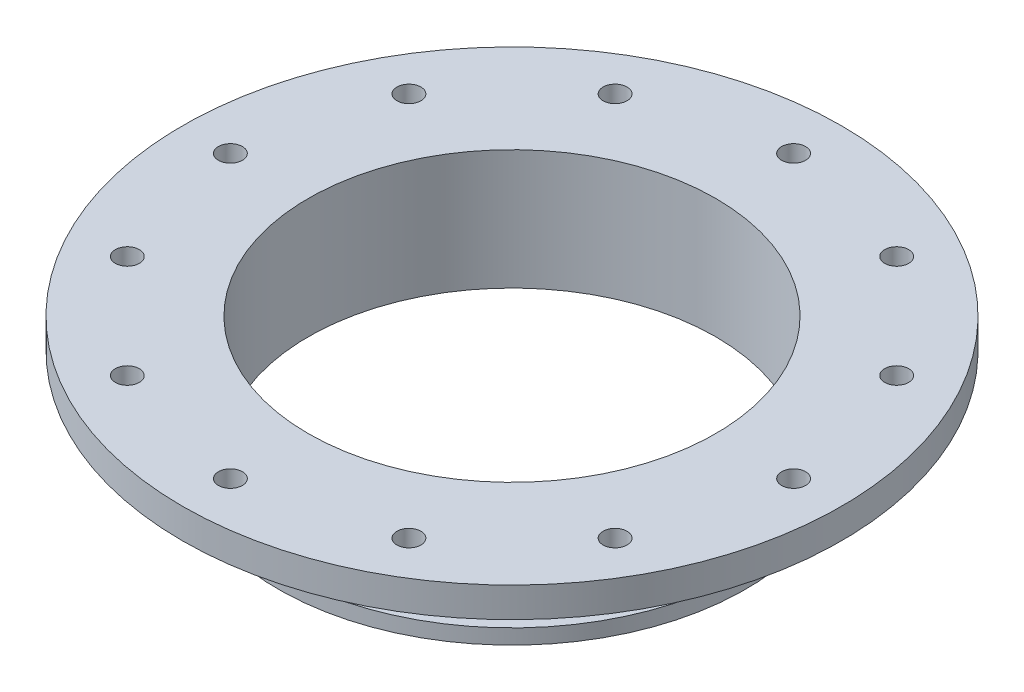
ISO-10303-21;
HEADER;
FILE_DESCRIPTION(('STEP AP214'),'2;1');
FILE_NAME('part.step','',(''),(''),'','','');
FILE_SCHEMA(('AUTOMOTIVE_DESIGN { 1 0 10303 214 1 1 1 1 }'));
ENDSEC;
DATA;
#1=APPLICATION_CONTEXT('core data for automotive mechanical design processes');
#2=APPLICATION_PROTOCOL_DEFINITION('international standard','automotive_design',2000,#1);
#3=PRODUCT_CONTEXT('',#1,'mechanical');
#4=PRODUCT('Part','Part','',(#3));
#5=PRODUCT_RELATED_PRODUCT_CATEGORY('part','',(#4));
#6=PRODUCT_DEFINITION_FORMATION('','',#4);
#7=PRODUCT_DEFINITION_CONTEXT('part definition',#1,'design');
#8=PRODUCT_DEFINITION('design','',#6,#7);
#9=PRODUCT_DEFINITION_SHAPE('','',#8);
#10=(LENGTH_UNIT() NAMED_UNIT(*) SI_UNIT(.MILLI.,.METRE.));
#11=(NAMED_UNIT(*) PLANE_ANGLE_UNIT() SI_UNIT($,.RADIAN.));
#12=(NAMED_UNIT(*) SI_UNIT($,.STERADIAN.) SOLID_ANGLE_UNIT());
#13=UNCERTAINTY_MEASURE_WITH_UNIT(LENGTH_MEASURE(1.E-05),#10,'distance_accuracy_value','');
#14=(GEOMETRIC_REPRESENTATION_CONTEXT(3) GLOBAL_UNCERTAINTY_ASSIGNED_CONTEXT((#13)) GLOBAL_UNIT_ASSIGNED_CONTEXT((#10,
#11,#12)) REPRESENTATION_CONTEXT('',''));
#15=CARTESIAN_POINT('',(0.,0.,0.));
#16=DIRECTION('',(0.,0.,1.));
#17=DIRECTION('',(1.,0.,0.));
#18=AXIS2_PLACEMENT_3D('',#15,#16,#17);
#19=CARTESIAN_POINT('',(0.,-25.4,0.));
#20=DIRECTION('',(0.,1.,0.));
#21=DIRECTION('',(0.,0.,1.));
#22=AXIS2_PLACEMENT_3D('',#19,#20,#21);
#23=CYLINDRICAL_SURFACE('',#22,49.53);
#24=CARTESIAN_POINT('',(0.,-6.35,0.));
#25=DIRECTION('',(0.,-1.,0.));
#26=DIRECTION('',(0.,0.,-1.));
#27=AXIS2_PLACEMENT_3D('',#24,#25,#26);
#28=CIRCLE('',#27,49.53);
#29=CARTESIAN_POINT('',(0.,-6.35,-49.53));
#30=VERTEX_POINT('',#29);
#31=EDGE_CURVE('E55',#30,#30,#28,.T.);
#32=ORIENTED_EDGE('',*,*,#31,.T.);
#33=EDGE_LOOP('',(#32));
#34=FACE_BOUND('',#33,.T.);
#35=CARTESIAN_POINT('',(0.,-9.52500000000001,0.));
#36=DIRECTION('',(0.,1.,0.));
#37=DIRECTION('',(-1.,0.,0.));
#38=AXIS2_PLACEMENT_3D('',#35,#36,#37);
#39=CIRCLE('',#38,49.53);
#40=CARTESIAN_POINT('',(-49.53,-9.52500000000001,0.));
#41=VERTEX_POINT('',#40);
#42=EDGE_CURVE('E64',#41,#41,#39,.T.);
#43=ORIENTED_EDGE('',*,*,#42,.T.);
#44=EDGE_LOOP('',(#43));
#45=FACE_BOUND('',#44,.T.);
#46=ADVANCED_FACE('F37',(#34,#45),#23,.T.);
#47=CARTESIAN_POINT('',(43.18,-6.35,0.));
#48=DIRECTION('',(0.,-1.,0.));
#49=DIRECTION('',(0.,0.,-1.));
#50=AXIS2_PLACEMENT_3D('',#47,#48,#49);
#51=PLANE('',#50);
#52=CARTESIAN_POINT('',(-29.8449999999999,-6.35,-51.6930563518932));
#53=DIRECTION('',(0.,-1.,0.));
#54=DIRECTION('',(0.,0.,-1.));
#55=AXIS2_PLACEMENT_3D('',#52,#53,#54);
#56=CIRCLE('',#55,2.54);
#57=CARTESIAN_POINT('',(-29.8449999999999,-6.35,-54.2330563518932));
#58=VERTEX_POINT('',#57);
#59=EDGE_CURVE('E105',#58,#58,#56,.T.);
#60=ORIENTED_EDGE('',*,*,#59,.F.);
#61=EDGE_LOOP('',(#60));
#62=FACE_BOUND('',#61,.T.);
#63=CARTESIAN_POINT('',(2.07162279967613E-13,-6.35,-59.69));
#64=DIRECTION('',(0.,-1.,0.));
#65=DIRECTION('',(0.,0.,-1.));
#66=AXIS2_PLACEMENT_3D('',#63,#64,#65);
#67=CIRCLE('',#66,2.54);
#68=CARTESIAN_POINT('',(2.07162279967613E-13,-6.35,-62.23));
#69=VERTEX_POINT('',#68);
#70=EDGE_CURVE('E108',#69,#69,#67,.T.);
#71=ORIENTED_EDGE('',*,*,#70,.F.);
#72=EDGE_LOOP('',(#71));
#73=FACE_BOUND('',#72,.T.);
#74=CARTESIAN_POINT('',(29.8450000000003,-6.35,-51.693056351893));
#75=DIRECTION('',(0.,-1.,0.));
#76=DIRECTION('',(0.,0.,-1.));
#77=AXIS2_PLACEMENT_3D('',#74,#75,#76);
#78=CIRCLE('',#77,2.54);
#79=CARTESIAN_POINT('',(29.8450000000003,-6.35,-54.233056351893));
#80=VERTEX_POINT('',#79);
#81=EDGE_CURVE('E111',#80,#80,#78,.T.);
#82=ORIENTED_EDGE('',*,*,#81,.F.);
#83=EDGE_LOOP('',(#82));
#84=FACE_BOUND('',#83,.T.);
#85=CARTESIAN_POINT('',(51.6930563518933,-6.35,-29.8449999999997));
#86=DIRECTION('',(0.,-1.,0.));
#87=DIRECTION('',(0.,0.,-1.));
#88=AXIS2_PLACEMENT_3D('',#85,#86,#87);
#89=CIRCLE('',#88,2.54);
#90=CARTESIAN_POINT('',(51.6930563518933,-6.35,-32.3849999999997));
#91=VERTEX_POINT('',#90);
#92=EDGE_CURVE('E114',#91,#91,#89,.T.);
#93=ORIENTED_EDGE('',*,*,#92,.F.);
#94=EDGE_LOOP('',(#93));
#95=FACE_BOUND('',#94,.T.);
#96=CARTESIAN_POINT('',(59.69,-6.35,0.));
#97=DIRECTION('',(0.,-1.,0.));
#98=DIRECTION('',(0.,0.,-1.));
#99=AXIS2_PLACEMENT_3D('',#96,#97,#98);
#100=CIRCLE('',#99,2.54);
#101=CARTESIAN_POINT('',(59.69,-6.35,-2.54));
#102=VERTEX_POINT('',#101);
#103=EDGE_CURVE('E117',#102,#102,#100,.T.);
#104=ORIENTED_EDGE('',*,*,#103,.F.);
#105=EDGE_LOOP('',(#104));
#106=FACE_BOUND('',#105,.T.);
#107=CARTESIAN_POINT('',(51.6930563518929,-6.35,29.8450000000004));
#108=DIRECTION('',(0.,-1.,0.));
#109=DIRECTION('',(0.,0.,-1.));
#110=AXIS2_PLACEMENT_3D('',#107,#108,#109);
#111=CIRCLE('',#110,2.54);
#112=CARTESIAN_POINT('',(51.6930563518929,-6.35,27.3050000000004));
#113=VERTEX_POINT('',#112);
#114=EDGE_CURVE('E120',#113,#113,#111,.T.);
#115=ORIENTED_EDGE('',*,*,#114,.F.);
#116=EDGE_LOOP('',(#115));
#117=FACE_BOUND('',#116,.T.);
#118=CARTESIAN_POINT('',(29.8449999999995,-6.35,51.6930563518934));
#119=DIRECTION('',(0.,-1.,0.));
#120=DIRECTION('',(0.,0.,-1.));
#121=AXIS2_PLACEMENT_3D('',#118,#119,#120);
#122=CIRCLE('',#121,2.54);
#123=CARTESIAN_POINT('',(29.8449999999995,-6.35,49.1530563518934));
#124=VERTEX_POINT('',#123);
#125=EDGE_CURVE('E123',#124,#124,#122,.T.);
#126=ORIENTED_EDGE('',*,*,#125,.F.);
#127=EDGE_LOOP('',(#126));
#128=FACE_BOUND('',#127,.T.);
#129=CARTESIAN_POINT('',(-6.23975322198706E-13,-6.35,59.69));
#130=DIRECTION('',(0.,-1.,0.));
#131=DIRECTION('',(0.,0.,-1.));
#132=AXIS2_PLACEMENT_3D('',#129,#130,#131);
#133=CIRCLE('',#132,2.54);
#134=CARTESIAN_POINT('',(-6.23975322198706E-13,-6.35,57.15));
#135=VERTEX_POINT('',#134);
#136=EDGE_CURVE('E126',#135,#135,#133,.T.);
#137=ORIENTED_EDGE('',*,*,#136,.F.);
#138=EDGE_LOOP('',(#137));
#139=FACE_BOUND('',#138,.T.);
#140=CARTESIAN_POINT('',(-29.8450000000006,-6.35,51.6930563518928));
#141=DIRECTION('',(0.,-1.,0.));
#142=DIRECTION('',(0.,0.,-1.));
#143=AXIS2_PLACEMENT_3D('',#140,#141,#142);
#144=CIRCLE('',#143,2.54);
#145=CARTESIAN_POINT('',(-29.8450000000006,-6.35,49.1530563518928));
#146=VERTEX_POINT('',#145);
#147=EDGE_CURVE('E129',#146,#146,#144,.T.);
#148=ORIENTED_EDGE('',*,*,#147,.F.);
#149=EDGE_LOOP('',(#148));
#150=FACE_BOUND('',#149,.T.);
#151=CARTESIAN_POINT('',(-51.6930563518935,-6.35,29.8449999999993));
#152=DIRECTION('',(0.,-1.,0.));
#153=DIRECTION('',(0.,0.,-1.));
#154=AXIS2_PLACEMENT_3D('',#151,#152,#153);
#155=CIRCLE('',#154,2.54);
#156=CARTESIAN_POINT('',(-51.6930563518935,-6.35,27.3049999999993));
#157=VERTEX_POINT('',#156);
#158=EDGE_CURVE('E132',#157,#157,#155,.T.);
#159=ORIENTED_EDGE('',*,*,#158,.F.);
#160=EDGE_LOOP('',(#159));
#161=FACE_BOUND('',#160,.T.);
#162=CARTESIAN_POINT('',(-51.6930563518931,-6.35,-29.8450000000001));
#163=DIRECTION('',(0.,-1.,0.));
#164=DIRECTION('',(0.,0.,-1.));
#165=AXIS2_PLACEMENT_3D('',#162,#163,#164);
#166=CIRCLE('',#165,2.54);
#167=CARTESIAN_POINT('',(-51.6930563518931,-6.35,-32.3850000000001));
#168=VERTEX_POINT('',#167);
#169=EDGE_CURVE('E135',#168,#168,#166,.T.);
#170=ORIENTED_EDGE('',*,*,#169,.F.);
#171=EDGE_LOOP('',(#170));
#172=FACE_BOUND('',#171,.T.);
#173=CARTESIAN_POINT('',(-59.69,-6.35,0.));
#174=DIRECTION('',(0.,-1.,0.));
#175=DIRECTION('',(0.,0.,-1.));
#176=AXIS2_PLACEMENT_3D('',#173,#174,#175);
#177=CIRCLE('',#176,2.54);
#178=CARTESIAN_POINT('',(-59.69,-6.35,-2.54));
#179=VERTEX_POINT('',#178);
#180=EDGE_CURVE('E77',#179,#179,#177,.T.);
#181=ORIENTED_EDGE('',*,*,#180,.F.);
#182=EDGE_LOOP('',(#181));
#183=FACE_BOUND('',#182,.T.);
#184=CARTESIAN_POINT('',(0.,-6.34999999999999,0.));
#185=DIRECTION('',(0.,-1.,0.));
#186=DIRECTION('',(0.,0.,-1.));
#187=AXIS2_PLACEMENT_3D('',#184,#185,#186);
#188=CIRCLE('',#187,69.85);
#189=CARTESIAN_POINT('',(0.,-6.34999999999999,-69.85));
#190=VERTEX_POINT('',#189);
#191=EDGE_CURVE('E44',#190,#190,#188,.T.);
#192=ORIENTED_EDGE('',*,*,#191,.T.);
#193=EDGE_LOOP('',(#192));
#194=FACE_BOUND('',#193,.T.);
#195=ORIENTED_EDGE('',*,*,#31,.F.);
#196=EDGE_LOOP('',(#195));
#197=FACE_BOUND('',#196,.T.);
#198=ADVANCED_FACE('F177',(#62,#73,#84,#95,#106,#117,#128,#139,#150,#161,#172,#183,#194,#197),
#51,.T.);
#199=CARTESIAN_POINT('',(43.18,0.,0.));
#200=DIRECTION('',(0.,1.,0.));
#201=DIRECTION('',(0.,0.,1.));
#202=AXIS2_PLACEMENT_3D('',#199,#200,#201);
#203=PLANE('',#202);
#204=CARTESIAN_POINT('',(-29.8449999999999,0.,-51.6930563518932));
#205=DIRECTION('',(0.,1.,0.));
#206=DIRECTION('',(-0.86602540378444,0.,0.499999999999998));
#207=AXIS2_PLACEMENT_3D('',#204,#205,#206);
#208=CIRCLE('',#207,2.54);
#209=CARTESIAN_POINT('',(-32.0447045256124,0.,-50.4230563518932));
#210=VERTEX_POINT('',#209);
#211=EDGE_CURVE('E141',#210,#210,#208,.T.);
#212=ORIENTED_EDGE('',*,*,#211,.F.);
#213=EDGE_LOOP('',(#212));
#214=FACE_BOUND('',#213,.T.);
#215=CARTESIAN_POINT('',(2.07162279967613E-13,0.,-59.69));
#216=DIRECTION('',(0.,1.,0.));
#217=DIRECTION('',(-1.,0.,0.));
#218=AXIS2_PLACEMENT_3D('',#215,#216,#217);
#219=CIRCLE('',#218,2.54);
#220=CARTESIAN_POINT('',(-2.53999999999979,0.,-59.69));
#221=VERTEX_POINT('',#220);
#222=EDGE_CURVE('E161',#221,#221,#219,.T.);
#223=ORIENTED_EDGE('',*,*,#222,.F.);
#224=EDGE_LOOP('',(#223));
#225=FACE_BOUND('',#224,.T.);
#226=CARTESIAN_POINT('',(29.8450000000003,0.,-51.693056351893));
#227=DIRECTION('',(0.,1.,0.));
#228=DIRECTION('',(-0.866025403784436,0.,-0.500000000000004));
#229=AXIS2_PLACEMENT_3D('',#226,#227,#228);
#230=CIRCLE('',#229,2.54);
#231=CARTESIAN_POINT('',(27.6452954743878,0.,-52.963056351893));
#232=VERTEX_POINT('',#231);
#233=EDGE_CURVE('E158',#232,#232,#230,.T.);
#234=ORIENTED_EDGE('',*,*,#233,.F.);
#235=EDGE_LOOP('',(#234));
#236=FACE_BOUND('',#235,.T.);
#237=CARTESIAN_POINT('',(51.6930563518933,0.,-29.8449999999997));
#238=DIRECTION('',(0.,1.,0.));
#239=DIRECTION('',(-0.499999999999995,0.,-0.866025403784442));
#240=AXIS2_PLACEMENT_3D('',#237,#238,#239);
#241=CIRCLE('',#240,2.54);
#242=CARTESIAN_POINT('',(50.4230563518933,0.,-32.0447045256122));
#243=VERTEX_POINT('',#242);
#244=EDGE_CURVE('E155',#243,#243,#241,.T.);
#245=ORIENTED_EDGE('',*,*,#244,.F.);
#246=EDGE_LOOP('',(#245));
#247=FACE_BOUND('',#246,.T.);
#248=CARTESIAN_POINT('',(59.69,0.,0.));
#249=DIRECTION('',(0.,1.,0.));
#250=DIRECTION('',(0.,0.,-1.));
#251=AXIS2_PLACEMENT_3D('',#248,#249,#250);
#252=CIRCLE('',#251,2.54);
#253=CARTESIAN_POINT('',(59.69,0.,-2.54));
#254=VERTEX_POINT('',#253);
#255=EDGE_CURVE('E152',#254,#254,#252,.T.);
#256=ORIENTED_EDGE('',*,*,#255,.F.);
#257=EDGE_LOOP('',(#256));
#258=FACE_BOUND('',#257,.T.);
#259=CARTESIAN_POINT('',(51.6930563518929,0.,29.8450000000004));
#260=DIRECTION('',(0.,1.,0.));
#261=DIRECTION('',(0.500000000000007,0.,-0.866025403784435));
#262=AXIS2_PLACEMENT_3D('',#259,#260,#261);
#263=CIRCLE('',#262,2.54);
#264=CARTESIAN_POINT('',(52.9630563518929,0.,27.645295474388));
#265=VERTEX_POINT('',#264);
#266=EDGE_CURVE('E149',#265,#265,#263,.T.);
#267=ORIENTED_EDGE('',*,*,#266,.F.);
#268=EDGE_LOOP('',(#267));
#269=FACE_BOUND('',#268,.T.);
#270=CARTESIAN_POINT('',(29.8449999999995,0.,51.6930563518934));
#271=DIRECTION('',(0.,1.,0.));
#272=DIRECTION('',(0.866025403784443,0.,-0.499999999999992));
#273=AXIS2_PLACEMENT_3D('',#270,#271,#272);
#274=CIRCLE('',#273,2.54);
#275=CARTESIAN_POINT('',(32.044704525612,0.,50.4230563518935));
#276=VERTEX_POINT('',#275);
#277=EDGE_CURVE('E145',#276,#276,#274,.T.);
#278=ORIENTED_EDGE('',*,*,#277,.F.);
#279=EDGE_LOOP('',(#278));
#280=FACE_BOUND('',#279,.T.);
#281=CARTESIAN_POINT('',(-6.23975322198706E-13,0.,59.69));
#282=DIRECTION('',(0.,1.,0.));
#283=DIRECTION('',(1.,0.,0.));
#284=AXIS2_PLACEMENT_3D('',#281,#282,#283);
#285=CIRCLE('',#284,2.54);
#286=CARTESIAN_POINT('',(2.53999999999938,0.,59.69));
#287=VERTEX_POINT('',#286);
#288=EDGE_CURVE('E142',#287,#287,#285,.T.);
#289=ORIENTED_EDGE('',*,*,#288,.F.);
#290=EDGE_LOOP('',(#289));
#291=FACE_BOUND('',#290,.T.);
#292=CARTESIAN_POINT('',(-29.8450000000006,0.,51.6930563518928));
#293=DIRECTION('',(0.,1.,0.));
#294=DIRECTION('',(0.866025403784433,0.,0.50000000000001));
#295=AXIS2_PLACEMENT_3D('',#292,#293,#294);
#296=CIRCLE('',#295,2.54);
#297=CARTESIAN_POINT('',(-27.6452954743881,0.,52.9630563518928));
#298=VERTEX_POINT('',#297);
#299=EDGE_CURVE('E146',#298,#298,#296,.T.);
#300=ORIENTED_EDGE('',*,*,#299,.F.);
#301=EDGE_LOOP('',(#300));
#302=FACE_BOUND('',#301,.T.);
#303=CARTESIAN_POINT('',(-51.6930563518935,0.,29.8449999999993));
#304=DIRECTION('',(0.,1.,0.));
#305=DIRECTION('',(0.499999999999989,0.,0.866025403784445));
#306=AXIS2_PLACEMENT_3D('',#303,#304,#305);
#307=CIRCLE('',#306,2.54);
#308=CARTESIAN_POINT('',(-50.4230563518936,0.,32.0447045256118));
#309=VERTEX_POINT('',#308);
#310=EDGE_CURVE('E166',#309,#309,#307,.T.);
#311=ORIENTED_EDGE('',*,*,#310,.F.);
#312=EDGE_LOOP('',(#311));
#313=FACE_BOUND('',#312,.T.);
#314=CARTESIAN_POINT('',(-51.6930563518931,0.,-29.8450000000001));
#315=DIRECTION('',(0.,1.,0.));
#316=DIRECTION('',(-0.500000000000001,0.,0.866025403784438));
#317=AXIS2_PLACEMENT_3D('',#314,#315,#316);
#318=CIRCLE('',#317,2.54);
#319=CARTESIAN_POINT('',(-52.9630563518931,0.,-27.6452954743876));
#320=VERTEX_POINT('',#319);
#321=EDGE_CURVE('E138',#320,#320,#318,.T.);
#322=ORIENTED_EDGE('',*,*,#321,.F.);
#323=EDGE_LOOP('',(#322));
#324=FACE_BOUND('',#323,.T.);
#325=CARTESIAN_POINT('',(-59.69,0.,0.));
#326=DIRECTION('',(0.,1.,0.));
#327=DIRECTION('',(0.,0.,1.));
#328=AXIS2_PLACEMENT_3D('',#325,#326,#327);
#329=CIRCLE('',#328,2.54);
#330=CARTESIAN_POINT('',(-59.69,0.,2.54));
#331=VERTEX_POINT('',#330);
#332=EDGE_CURVE('E102',#331,#331,#329,.T.);
#333=ORIENTED_EDGE('',*,*,#332,.F.);
#334=EDGE_LOOP('',(#333));
#335=FACE_BOUND('',#334,.T.);
#336=CARTESIAN_POINT('',(0.,0.,0.));
#337=DIRECTION('',(0.,-1.,0.));
#338=DIRECTION('',(0.,0.,-1.));
#339=AXIS2_PLACEMENT_3D('',#336,#337,#338);
#340=CIRCLE('',#339,43.18);
#341=CARTESIAN_POINT('',(0.,0.,-43.18));
#342=VERTEX_POINT('',#341);
#343=EDGE_CURVE('E10',#342,#342,#340,.T.);
#344=ORIENTED_EDGE('',*,*,#343,.T.);
#345=EDGE_LOOP('',(#344));
#346=FACE_BOUND('',#345,.T.);
#347=CARTESIAN_POINT('',(0.,0.,0.));
#348=DIRECTION('',(0.,-1.,0.));
#349=DIRECTION('',(0.,0.,-1.));
#350=AXIS2_PLACEMENT_3D('',#347,#348,#349);
#351=CIRCLE('',#350,69.85);
#352=CARTESIAN_POINT('',(0.,0.,-69.85));
#353=VERTEX_POINT('',#352);
#354=EDGE_CURVE('E48',#353,#353,#351,.T.);
#355=ORIENTED_EDGE('',*,*,#354,.F.);
#356=EDGE_LOOP('',(#355));
#357=FACE_BOUND('',#356,.T.);
#358=ADVANCED_FACE('F39',(#214,#225,#236,#247,#258,#269,#280,#291,#302,#313,#324,#335,#346,
#357),#203,.T.);
#359=CARTESIAN_POINT('',(0.,-127.,0.));
#360=DIRECTION('',(0.,-1.,0.));
#361=DIRECTION('',(0.,0.,-1.));
#362=AXIS2_PLACEMENT_3D('',#359,#360,#361);
#363=CYLINDRICAL_SURFACE('',#362,43.18);
#364=ORIENTED_EDGE('',*,*,#343,.F.);
#365=EDGE_LOOP('',(#364));
#366=FACE_BOUND('',#365,.T.);
#367=CARTESIAN_POINT('',(0.,-25.4,0.));
#368=DIRECTION('',(0.,-1.,0.));
#369=DIRECTION('',(0.,0.,-1.));
#370=AXIS2_PLACEMENT_3D('',#367,#368,#369);
#371=CIRCLE('',#370,43.18);
#372=CARTESIAN_POINT('',(0.,-25.4,-43.18));
#373=VERTEX_POINT('',#372);
#374=EDGE_CURVE('E58',#373,#373,#371,.T.);
#375=ORIENTED_EDGE('',*,*,#374,.T.);
#376=EDGE_LOOP('',(#375));
#377=FACE_BOUND('',#376,.T.);
#378=ADVANCED_FACE('F176',(#366,#377),#363,.F.);
#379=CARTESIAN_POINT('',(0.,-127.,0.));
#380=DIRECTION('',(0.,-1.,0.));
#381=DIRECTION('',(0.,0.,-1.));
#382=AXIS2_PLACEMENT_3D('',#379,#380,#381);
#383=CYLINDRICAL_SURFACE('',#382,69.85);
#384=ORIENTED_EDGE('',*,*,#354,.T.);
#385=EDGE_LOOP('',(#384));
#386=FACE_BOUND('',#385,.T.);
#387=ORIENTED_EDGE('',*,*,#191,.F.);
#388=EDGE_LOOP('',(#387));
#389=FACE_BOUND('',#388,.T.);
#390=ADVANCED_FACE('F187',(#386,#389),#383,.T.);
#391=CARTESIAN_POINT('',(0.,-25.4,0.));
#392=DIRECTION('',(0.,-1.,0.));
#393=DIRECTION('',(0.,0.,-1.));
#394=AXIS2_PLACEMENT_3D('',#391,#392,#393);
#395=PLANE('',#394);
#396=CARTESIAN_POINT('',(0.,-25.4,0.));
#397=DIRECTION('',(0.,-1.,0.));
#398=DIRECTION('',(0.,0.,-1.));
#399=AXIS2_PLACEMENT_3D('',#396,#397,#398);
#400=CIRCLE('',#399,49.53);
#401=CARTESIAN_POINT('',(0.,-25.4,-49.53));
#402=VERTEX_POINT('',#401);
#403=EDGE_CURVE('E52',#402,#402,#400,.T.);
#404=ORIENTED_EDGE('',*,*,#403,.T.);
#405=EDGE_LOOP('',(#404));
#406=FACE_BOUND('',#405,.T.);
#407=ORIENTED_EDGE('',*,*,#374,.F.);
#408=EDGE_LOOP('',(#407));
#409=FACE_BOUND('',#408,.T.);
#410=ADVANCED_FACE('F190',(#406,#409),#395,.T.);
#411=CARTESIAN_POINT('',(0.,-22.225,0.));
#412=DIRECTION('',(0.,1.,0.));
#413=DIRECTION('',(-1.,0.,0.));
#414=AXIS2_PLACEMENT_3D('',#411,#412,#413);
#415=CIRCLE('',#414,49.53);
#416=CARTESIAN_POINT('',(-49.53,-22.225,0.));
#417=VERTEX_POINT('',#416);
#418=EDGE_CURVE('E81',#417,#417,#415,.T.);
#419=ORIENTED_EDGE('',*,*,#418,.F.);
#420=EDGE_LOOP('',(#419));
#421=FACE_BOUND('',#420,.T.);
#422=ORIENTED_EDGE('',*,*,#403,.F.);
#423=EDGE_LOOP('',(#422));
#424=FACE_BOUND('',#423,.T.);
#425=ADVANCED_FACE('F196',(#421,#424),#23,.T.);
#426=CARTESIAN_POINT('',(0.,-9.52500000000001,0.));
#427=DIRECTION('',(0.,-1.,0.));
#428=DIRECTION('',(1.,0.,0.));
#429=AXIS2_PLACEMENT_3D('',#426,#427,#428);
#430=PLANE('',#429);
#431=CARTESIAN_POINT('',(0.,-9.52500000000001,0.));
#432=DIRECTION('',(0.,1.,0.));
#433=DIRECTION('',(-1.,0.,0.));
#434=AXIS2_PLACEMENT_3D('',#431,#432,#433);
#435=CIRCLE('',#434,46.355);
#436=CARTESIAN_POINT('',(-46.355,-9.52500000000001,0.));
#437=VERTEX_POINT('',#436);
#438=EDGE_CURVE('E68',#437,#437,#435,.T.);
#439=ORIENTED_EDGE('',*,*,#438,.T.);
#440=EDGE_LOOP('',(#439));
#441=FACE_BOUND('',#440,.T.);
#442=ORIENTED_EDGE('',*,*,#42,.F.);
#443=EDGE_LOOP('',(#442));
#444=FACE_BOUND('',#443,.T.);
#445=ADVANCED_FACE('F211',(#441,#444),#430,.T.);
#446=CARTESIAN_POINT('',(0.,0.,0.));
#447=DIRECTION('',(0.,1.,0.));
#448=DIRECTION('',(-1.,0.,0.));
#449=AXIS2_PLACEMENT_3D('',#446,#447,#448);
#450=CYLINDRICAL_SURFACE('',#449,46.355);
#451=ORIENTED_EDGE('',*,*,#438,.F.);
#452=EDGE_LOOP('',(#451));
#453=FACE_BOUND('',#452,.T.);
#454=CARTESIAN_POINT('',(0.,-11.6416666666667,0.));
#455=DIRECTION('',(0.,1.,0.));
#456=DIRECTION('',(-1.,0.,0.));
#457=AXIS2_PLACEMENT_3D('',#454,#455,#456);
#458=CIRCLE('',#457,46.355);
#459=CARTESIAN_POINT('',(-46.355,-11.6416666666667,0.));
#460=VERTEX_POINT('',#459);
#461=EDGE_CURVE('E71',#460,#460,#458,.T.);
#462=ORIENTED_EDGE('',*,*,#461,.T.);
#463=EDGE_LOOP('',(#462));
#464=FACE_BOUND('',#463,.T.);
#465=ADVANCED_FACE('F246',(#453,#464),#450,.T.);
#466=CARTESIAN_POINT('',(0.,-11.6416666666667,0.));
#467=DIRECTION('',(0.,-1.,0.));
#468=DIRECTION('',(1.,0.,0.));
#469=AXIS2_PLACEMENT_3D('',#466,#467,#468);
#470=PLANE('',#469);
#471=ORIENTED_EDGE('',*,*,#461,.F.);
#472=EDGE_LOOP('',(#471));
#473=FACE_BOUND('',#472,.T.);
#474=CARTESIAN_POINT('',(0.,-11.6416666666667,0.));
#475=DIRECTION('',(0.,1.,0.));
#476=DIRECTION('',(-1.,0.,0.));
#477=AXIS2_PLACEMENT_3D('',#474,#475,#476);
#478=CIRCLE('',#477,49.53);
#479=CARTESIAN_POINT('',(-49.53,-11.6416666666667,0.));
#480=VERTEX_POINT('',#479);
#481=EDGE_CURVE('E74',#480,#480,#478,.T.);
#482=ORIENTED_EDGE('',*,*,#481,.T.);
#483=EDGE_LOOP('',(#482));
#484=FACE_BOUND('',#483,.T.);
#485=ADVANCED_FACE('F242',(#473,#484),#470,.F.);
#486=CARTESIAN_POINT('',(0.,-20.1083333333333,0.));
#487=DIRECTION('',(0.,-1.,0.));
#488=DIRECTION('',(1.,0.,0.));
#489=AXIS2_PLACEMENT_3D('',#486,#487,#488);
#490=PLANE('',#489);
#491=CARTESIAN_POINT('',(0.,-20.1083333333333,0.));
#492=DIRECTION('',(0.,1.,0.));
#493=DIRECTION('',(-1.,0.,0.));
#494=AXIS2_PLACEMENT_3D('',#491,#492,#493);
#495=CIRCLE('',#494,46.355);
#496=CARTESIAN_POINT('',(-46.355,-20.1083333333333,0.));
#497=VERTEX_POINT('',#496);
#498=EDGE_CURVE('E92',#497,#497,#495,.T.);
#499=ORIENTED_EDGE('',*,*,#498,.T.);
#500=EDGE_LOOP('',(#499));
#501=FACE_BOUND('',#500,.T.);
#502=CARTESIAN_POINT('',(0.,-20.1083333333333,0.));
#503=DIRECTION('',(0.,1.,0.));
#504=DIRECTION('',(-1.,0.,0.));
#505=AXIS2_PLACEMENT_3D('',#502,#503,#504);
#506=CIRCLE('',#505,49.53);
#507=CARTESIAN_POINT('',(-49.53,-20.1083333333333,0.));
#508=VERTEX_POINT('',#507);
#509=EDGE_CURVE('E63',#508,#508,#506,.T.);
#510=ORIENTED_EDGE('',*,*,#509,.F.);
#511=EDGE_LOOP('',(#510));
#512=FACE_BOUND('',#511,.T.);
#513=ADVANCED_FACE('F245',(#501,#512),#490,.T.);
#514=CARTESIAN_POINT('',(0.,0.,0.));
#515=DIRECTION('',(0.,1.,0.));
#516=DIRECTION('',(-1.,0.,0.));
#517=AXIS2_PLACEMENT_3D('',#514,#515,#516);
#518=CYLINDRICAL_SURFACE('',#517,46.355);
#519=ORIENTED_EDGE('',*,*,#498,.F.);
#520=EDGE_LOOP('',(#519));
#521=FACE_BOUND('',#520,.T.);
#522=CARTESIAN_POINT('',(0.,-22.225,0.));
#523=DIRECTION('',(0.,1.,0.));
#524=DIRECTION('',(-1.,0.,0.));
#525=AXIS2_PLACEMENT_3D('',#522,#523,#524);
#526=CIRCLE('',#525,46.355);
#527=CARTESIAN_POINT('',(-46.355,-22.225,0.));
#528=VERTEX_POINT('',#527);
#529=EDGE_CURVE('E95',#528,#528,#526,.T.);
#530=ORIENTED_EDGE('',*,*,#529,.T.);
#531=EDGE_LOOP('',(#530));
#532=FACE_BOUND('',#531,.T.);
#533=ADVANCED_FACE('F223',(#521,#532),#518,.T.);
#534=CARTESIAN_POINT('',(0.,-22.225,0.));
#535=DIRECTION('',(0.,-1.,0.));
#536=DIRECTION('',(1.,0.,0.));
#537=AXIS2_PLACEMENT_3D('',#534,#535,#536);
#538=PLANE('',#537);
#539=ORIENTED_EDGE('',*,*,#529,.F.);
#540=EDGE_LOOP('',(#539));
#541=FACE_BOUND('',#540,.T.);
#542=ORIENTED_EDGE('',*,*,#418,.T.);
#543=EDGE_LOOP('',(#542));
#544=FACE_BOUND('',#543,.T.);
#545=ADVANCED_FACE('F215',(#541,#544),#538,.F.);
#546=ORIENTED_EDGE('',*,*,#481,.F.);
#547=EDGE_LOOP('',(#546));
#548=FACE_BOUND('',#547,.T.);
#549=CARTESIAN_POINT('',(0.,-14.8166666666667,0.));
#550=DIRECTION('',(0.,1.,0.));
#551=DIRECTION('',(-1.,0.,0.));
#552=AXIS2_PLACEMENT_3D('',#549,#550,#551);
#553=CIRCLE('',#552,49.53);
#554=CARTESIAN_POINT('',(-49.53,-14.8166666666667,0.));
#555=VERTEX_POINT('',#554);
#556=EDGE_CURVE('E78',#555,#555,#553,.T.);
#557=ORIENTED_EDGE('',*,*,#556,.T.);
#558=EDGE_LOOP('',(#557));
#559=FACE_BOUND('',#558,.T.);
#560=ADVANCED_FACE('F204',(#548,#559),#23,.T.);
#561=CARTESIAN_POINT('',(0.,-16.9333333333333,0.));
#562=DIRECTION('',(0.,1.,0.));
#563=DIRECTION('',(-1.,0.,0.));
#564=AXIS2_PLACEMENT_3D('',#561,#562,#563);
#565=CIRCLE('',#564,49.53);
#566=CARTESIAN_POINT('',(-49.53,-16.9333333333333,0.));
#567=VERTEX_POINT('',#566);
#568=EDGE_CURVE('E67',#567,#567,#565,.T.);
#569=ORIENTED_EDGE('',*,*,#568,.F.);
#570=EDGE_LOOP('',(#569));
#571=FACE_BOUND('',#570,.T.);
#572=ORIENTED_EDGE('',*,*,#509,.T.);
#573=EDGE_LOOP('',(#572));
#574=FACE_BOUND('',#573,.T.);
#575=ADVANCED_FACE('F213',(#571,#574),#23,.T.);
#576=CARTESIAN_POINT('',(0.,-14.8166666666667,0.));
#577=DIRECTION('',(0.,-1.,0.));
#578=DIRECTION('',(1.,0.,0.));
#579=AXIS2_PLACEMENT_3D('',#576,#577,#578);
#580=PLANE('',#579);
#581=CARTESIAN_POINT('',(0.,-14.8166666666667,0.));
#582=DIRECTION('',(0.,1.,0.));
#583=DIRECTION('',(-1.,0.,0.));
#584=AXIS2_PLACEMENT_3D('',#581,#582,#583);
#585=CIRCLE('',#584,46.355);
#586=CARTESIAN_POINT('',(-46.355,-14.8166666666667,0.));
#587=VERTEX_POINT('',#586);
#588=EDGE_CURVE('E82',#587,#587,#585,.T.);
#589=ORIENTED_EDGE('',*,*,#588,.T.);
#590=EDGE_LOOP('',(#589));
#591=FACE_BOUND('',#590,.T.);
#592=ORIENTED_EDGE('',*,*,#556,.F.);
#593=EDGE_LOOP('',(#592));
#594=FACE_BOUND('',#593,.T.);
#595=ADVANCED_FACE('F221',(#591,#594),#580,.T.);
#596=CARTESIAN_POINT('',(0.,0.,0.));
#597=DIRECTION('',(0.,1.,0.));
#598=DIRECTION('',(-1.,0.,0.));
#599=AXIS2_PLACEMENT_3D('',#596,#597,#598);
#600=CYLINDRICAL_SURFACE('',#599,46.355);
#601=ORIENTED_EDGE('',*,*,#588,.F.);
#602=EDGE_LOOP('',(#601));
#603=FACE_BOUND('',#602,.T.);
#604=CARTESIAN_POINT('',(0.,-16.9333333333333,0.));
#605=DIRECTION('',(0.,1.,0.));
#606=DIRECTION('',(-1.,0.,0.));
#607=AXIS2_PLACEMENT_3D('',#604,#605,#606);
#608=CIRCLE('',#607,46.355);
#609=CARTESIAN_POINT('',(-46.355,-16.9333333333333,0.));
#610=VERTEX_POINT('',#609);
#611=EDGE_CURVE('E85',#610,#610,#608,.T.);
#612=ORIENTED_EDGE('',*,*,#611,.T.);
#613=EDGE_LOOP('',(#612));
#614=FACE_BOUND('',#613,.T.);
#615=ADVANCED_FACE('F231',(#603,#614),#600,.T.);
#616=CARTESIAN_POINT('',(0.,-16.9333333333333,0.));
#617=DIRECTION('',(0.,-1.,0.));
#618=DIRECTION('',(1.,0.,0.));
#619=AXIS2_PLACEMENT_3D('',#616,#617,#618);
#620=PLANE('',#619);
#621=ORIENTED_EDGE('',*,*,#611,.F.);
#622=EDGE_LOOP('',(#621));
#623=FACE_BOUND('',#622,.T.);
#624=ORIENTED_EDGE('',*,*,#568,.T.);
#625=EDGE_LOOP('',(#624));
#626=FACE_BOUND('',#625,.T.);
#627=ADVANCED_FACE('F237',(#623,#626),#620,.F.);
#628=CARTESIAN_POINT('',(-59.69,-25.4,0.));
#629=DIRECTION('',(0.,1.,0.));
#630=DIRECTION('',(0.,0.,1.));
#631=AXIS2_PLACEMENT_3D('',#628,#629,#630);
#632=CYLINDRICAL_SURFACE('',#631,2.54);
#633=ORIENTED_EDGE('',*,*,#180,.T.);
#634=EDGE_LOOP('',(#633));
#635=FACE_BOUND('',#634,.T.);
#636=ORIENTED_EDGE('',*,*,#332,.T.);
#637=EDGE_LOOP('',(#636));
#638=FACE_BOUND('',#637,.T.);
#639=ADVANCED_FACE('F320',(#635,#638),#632,.F.);
#640=CARTESIAN_POINT('',(-51.6930563518931,-25.4,-29.8450000000001));
#641=DIRECTION('',(0.,1.,0.));
#642=DIRECTION('',(0.,0.,1.));
#643=AXIS2_PLACEMENT_3D('',#640,#641,#642);
#644=CYLINDRICAL_SURFACE('',#643,2.54);
#645=ORIENTED_EDGE('',*,*,#169,.T.);
#646=EDGE_LOOP('',(#645));
#647=FACE_BOUND('',#646,.T.);
#648=ORIENTED_EDGE('',*,*,#321,.T.);
#649=EDGE_LOOP('',(#648));
#650=FACE_BOUND('',#649,.T.);
#651=ADVANCED_FACE('F329',(#647,#650),#644,.F.);
#652=CARTESIAN_POINT('',(-51.6930563518935,-25.4,29.8449999999993));
#653=DIRECTION('',(0.,1.,0.));
#654=DIRECTION('',(0.,0.,1.));
#655=AXIS2_PLACEMENT_3D('',#652,#653,#654);
#656=CYLINDRICAL_SURFACE('',#655,2.54);
#657=ORIENTED_EDGE('',*,*,#158,.T.);
#658=EDGE_LOOP('',(#657));
#659=FACE_BOUND('',#658,.T.);
#660=ORIENTED_EDGE('',*,*,#310,.T.);
#661=EDGE_LOOP('',(#660));
#662=FACE_BOUND('',#661,.T.);
#663=ADVANCED_FACE('F354',(#659,#662),#656,.F.);
#664=CARTESIAN_POINT('',(-29.8450000000006,-25.4,51.6930563518928));
#665=DIRECTION('',(0.,1.,0.));
#666=DIRECTION('',(0.,0.,1.));
#667=AXIS2_PLACEMENT_3D('',#664,#665,#666);
#668=CYLINDRICAL_SURFACE('',#667,2.54);
#669=ORIENTED_EDGE('',*,*,#147,.T.);
#670=EDGE_LOOP('',(#669));
#671=FACE_BOUND('',#670,.T.);
#672=ORIENTED_EDGE('',*,*,#299,.T.);
#673=EDGE_LOOP('',(#672));
#674=FACE_BOUND('',#673,.T.);
#675=ADVANCED_FACE('F172',(#671,#674),#668,.F.);
#676=CARTESIAN_POINT('',(-6.23975322198706E-13,-25.4,59.69));
#677=DIRECTION('',(0.,1.,0.));
#678=DIRECTION('',(0.,0.,1.));
#679=AXIS2_PLACEMENT_3D('',#676,#677,#678);
#680=CYLINDRICAL_SURFACE('',#679,2.54);
#681=ORIENTED_EDGE('',*,*,#136,.T.);
#682=EDGE_LOOP('',(#681));
#683=FACE_BOUND('',#682,.T.);
#684=ORIENTED_EDGE('',*,*,#288,.T.);
#685=EDGE_LOOP('',(#684));
#686=FACE_BOUND('',#685,.T.);
#687=ADVANCED_FACE('F373',(#683,#686),#680,.F.);
#688=CARTESIAN_POINT('',(29.8449999999995,-25.4,51.6930563518934));
#689=DIRECTION('',(0.,1.,0.));
#690=DIRECTION('',(0.,0.,1.));
#691=AXIS2_PLACEMENT_3D('',#688,#689,#690);
#692=CYLINDRICAL_SURFACE('',#691,2.54);
#693=ORIENTED_EDGE('',*,*,#125,.T.);
#694=EDGE_LOOP('',(#693));
#695=FACE_BOUND('',#694,.T.);
#696=ORIENTED_EDGE('',*,*,#277,.T.);
#697=EDGE_LOOP('',(#696));
#698=FACE_BOUND('',#697,.T.);
#699=ADVANCED_FACE('F383',(#695,#698),#692,.F.);
#700=CARTESIAN_POINT('',(51.6930563518929,-25.4,29.8450000000004));
#701=DIRECTION('',(0.,1.,0.));
#702=DIRECTION('',(0.,0.,1.));
#703=AXIS2_PLACEMENT_3D('',#700,#701,#702);
#704=CYLINDRICAL_SURFACE('',#703,2.54);
#705=ORIENTED_EDGE('',*,*,#114,.T.);
#706=EDGE_LOOP('',(#705));
#707=FACE_BOUND('',#706,.T.);
#708=ORIENTED_EDGE('',*,*,#266,.T.);
#709=EDGE_LOOP('',(#708));
#710=FACE_BOUND('',#709,.T.);
#711=ADVANCED_FACE('F393',(#707,#710),#704,.F.);
#712=CARTESIAN_POINT('',(59.69,-25.4,0.));
#713=DIRECTION('',(0.,1.,0.));
#714=DIRECTION('',(0.,0.,1.));
#715=AXIS2_PLACEMENT_3D('',#712,#713,#714);
#716=CYLINDRICAL_SURFACE('',#715,2.54);
#717=ORIENTED_EDGE('',*,*,#103,.T.);
#718=EDGE_LOOP('',(#717));
#719=FACE_BOUND('',#718,.T.);
#720=ORIENTED_EDGE('',*,*,#255,.T.);
#721=EDGE_LOOP('',(#720));
#722=FACE_BOUND('',#721,.T.);
#723=ADVANCED_FACE('F403',(#719,#722),#716,.F.);
#724=CARTESIAN_POINT('',(51.6930563518933,-25.4,-29.8449999999997));
#725=DIRECTION('',(0.,1.,0.));
#726=DIRECTION('',(0.,0.,1.));
#727=AXIS2_PLACEMENT_3D('',#724,#725,#726);
#728=CYLINDRICAL_SURFACE('',#727,2.54);
#729=ORIENTED_EDGE('',*,*,#92,.T.);
#730=EDGE_LOOP('',(#729));
#731=FACE_BOUND('',#730,.T.);
#732=ORIENTED_EDGE('',*,*,#244,.T.);
#733=EDGE_LOOP('',(#732));
#734=FACE_BOUND('',#733,.T.);
#735=ADVANCED_FACE('F413',(#731,#734),#728,.F.);
#736=CARTESIAN_POINT('',(29.8450000000003,-25.4,-51.693056351893));
#737=DIRECTION('',(0.,1.,0.));
#738=DIRECTION('',(0.,0.,1.));
#739=AXIS2_PLACEMENT_3D('',#736,#737,#738);
#740=CYLINDRICAL_SURFACE('',#739,2.54);
#741=ORIENTED_EDGE('',*,*,#81,.T.);
#742=EDGE_LOOP('',(#741));
#743=FACE_BOUND('',#742,.T.);
#744=ORIENTED_EDGE('',*,*,#233,.T.);
#745=EDGE_LOOP('',(#744));
#746=FACE_BOUND('',#745,.T.);
#747=ADVANCED_FACE('F423',(#743,#746),#740,.F.);
#748=CARTESIAN_POINT('',(2.07162279967613E-13,-25.4,-59.69));
#749=DIRECTION('',(0.,1.,0.));
#750=DIRECTION('',(0.,0.,1.));
#751=AXIS2_PLACEMENT_3D('',#748,#749,#750);
#752=CYLINDRICAL_SURFACE('',#751,2.54);
#753=ORIENTED_EDGE('',*,*,#70,.T.);
#754=EDGE_LOOP('',(#753));
#755=FACE_BOUND('',#754,.T.);
#756=ORIENTED_EDGE('',*,*,#222,.T.);
#757=EDGE_LOOP('',(#756));
#758=FACE_BOUND('',#757,.T.);
#759=ADVANCED_FACE('F433',(#755,#758),#752,.F.);
#760=CARTESIAN_POINT('',(-29.8449999999999,-25.4,-51.6930563518932));
#761=DIRECTION('',(0.,1.,0.));
#762=DIRECTION('',(0.,0.,1.));
#763=AXIS2_PLACEMENT_3D('',#760,#761,#762);
#764=CYLINDRICAL_SURFACE('',#763,2.54);
#765=ORIENTED_EDGE('',*,*,#59,.T.);
#766=EDGE_LOOP('',(#765));
#767=FACE_BOUND('',#766,.T.);
#768=ORIENTED_EDGE('',*,*,#211,.T.);
#769=EDGE_LOOP('',(#768));
#770=FACE_BOUND('',#769,.T.);
#771=ADVANCED_FACE('F443',(#767,#770),#764,.F.);
#772=CLOSED_SHELL('',(#46,#198,#358,#378,#390,#410,#425,#445,#465,#485,#513,#533,#545,#560,#575,
#595,#615,#627,#639,#651,#663,#675,#687,#699,#711,#723,#735,#747,#759,#771));
#773=MANIFOLD_SOLID_BREP('B2',#772);
#774=ADVANCED_BREP_SHAPE_REPRESENTATION('',(#18,#773),#14);
#775=SHAPE_DEFINITION_REPRESENTATION(#9,#774);
ENDSEC;
END-ISO-10303-21;
